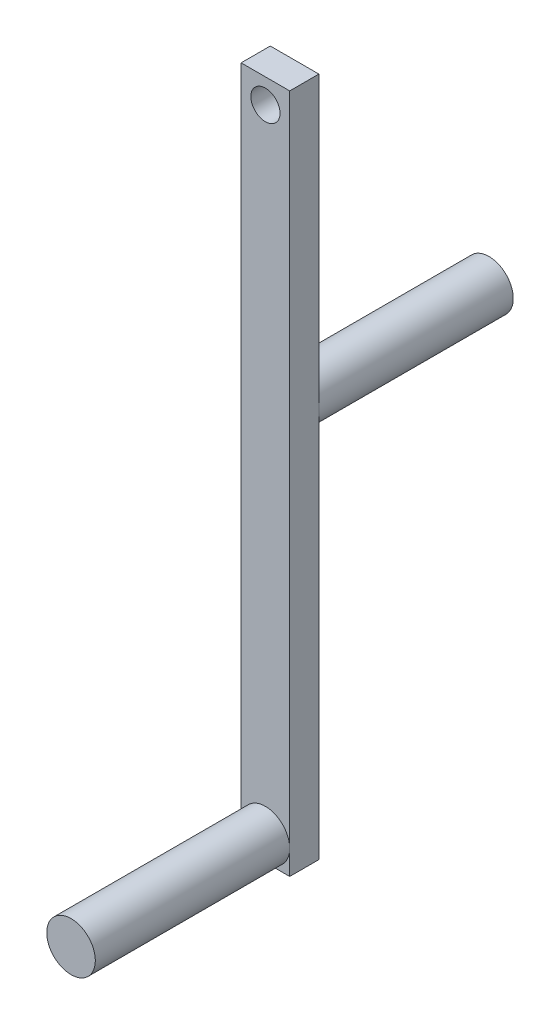
ISO-10303-21;
HEADER;
FILE_DESCRIPTION(('STEP AP214'),'2;1');
FILE_NAME('part.step','',(''),(''),'','','');
FILE_SCHEMA(('AUTOMOTIVE_DESIGN { 1 0 10303 214 1 1 1 1 }'));
ENDSEC;
DATA;
#1=APPLICATION_CONTEXT('core data for automotive mechanical design processes');
#2=APPLICATION_PROTOCOL_DEFINITION('international standard','automotive_design',2000,#1);
#3=PRODUCT_CONTEXT('',#1,'mechanical');
#4=PRODUCT('Part','Part','',(#3));
#5=PRODUCT_RELATED_PRODUCT_CATEGORY('part','',(#4));
#6=PRODUCT_DEFINITION_FORMATION('','',#4);
#7=PRODUCT_DEFINITION_CONTEXT('part definition',#1,'design');
#8=PRODUCT_DEFINITION('design','',#6,#7);
#9=PRODUCT_DEFINITION_SHAPE('','',#8);
#10=(LENGTH_UNIT() NAMED_UNIT(*) SI_UNIT(.MILLI.,.METRE.));
#11=(NAMED_UNIT(*) PLANE_ANGLE_UNIT() SI_UNIT($,.RADIAN.));
#12=(NAMED_UNIT(*) SI_UNIT($,.STERADIAN.) SOLID_ANGLE_UNIT());
#13=UNCERTAINTY_MEASURE_WITH_UNIT(LENGTH_MEASURE(1.E-05),#10,'distance_accuracy_value','');
#14=(GEOMETRIC_REPRESENTATION_CONTEXT(3) GLOBAL_UNCERTAINTY_ASSIGNED_CONTEXT((#13)) GLOBAL_UNIT_ASSIGNED_CONTEXT((#10,
#11,#12)) REPRESENTATION_CONTEXT('',''));
#15=CARTESIAN_POINT('',(0.,0.,0.));
#16=DIRECTION('',(0.,0.,1.));
#17=DIRECTION('',(1.,0.,0.));
#18=AXIS2_PLACEMENT_3D('',#15,#16,#17);
#19=CARTESIAN_POINT('',(0.,0.,0.));
#20=DIRECTION('',(0.,0.,-1.));
#21=DIRECTION('',(-1.,0.,0.));
#22=AXIS2_PLACEMENT_3D('',#19,#20,#21);
#23=PLANE('',#22);
#24=CARTESIAN_POINT('',(2.5,67.5,0.));
#25=DIRECTION('',(0.,0.,-1.));
#26=DIRECTION('',(-1.,0.,0.));
#27=AXIS2_PLACEMENT_3D('',#24,#25,#26);
#28=CIRCLE('',#27,1.5);
#29=CARTESIAN_POINT('',(0.999999999999999,67.5,0.));
#30=VERTEX_POINT('',#29);
#31=EDGE_CURVE('E269',#30,#30,#28,.T.);
#32=ORIENTED_EDGE('',*,*,#31,.F.);
#33=EDGE_LOOP('',(#32));
#34=FACE_BOUND('',#33,.T.);
#35=CARTESIAN_POINT('',(2.50000000000002,40.,0.));
#36=DIRECTION('',(0.,0.,-1.));
#37=DIRECTION('',(-1.,0.,0.));
#38=AXIS2_PLACEMENT_3D('',#35,#36,#37);
#39=CIRCLE('',#38,2.49999999999998);
#40=CARTESIAN_POINT('',(0.,40.,0.));
#41=VERTEX_POINT('',#40);
#42=CARTESIAN_POINT('',(5.,40.,0.));
#43=VERTEX_POINT('',#42);
#44=EDGE_CURVE('E44',#41,#43,#39,.T.);
#45=ORIENTED_EDGE('',*,*,#44,.F.);
#46=DIRECTION('',(0.,-1.,0.));
#47=VECTOR('',#46,1.);
#48=CARTESIAN_POINT('',(0.,0.,0.));
#49=LINE('',#48,#47);
#50=CARTESIAN_POINT('',(0.,70.,0.));
#51=VERTEX_POINT('',#50);
#52=EDGE_CURVE('E92',#51,#41,#49,.T.);
#53=ORIENTED_EDGE('',*,*,#52,.F.);
#54=DIRECTION('',(-1.,0.,0.));
#55=VECTOR('',#54,1.);
#56=CARTESIAN_POINT('',(0.,70.,0.));
#57=LINE('',#56,#55);
#58=CARTESIAN_POINT('',(5.,70.,0.));
#59=VERTEX_POINT('',#58);
#60=EDGE_CURVE('E174',#59,#51,#57,.T.);
#61=ORIENTED_EDGE('',*,*,#60,.F.);
#62=DIRECTION('',(0.,1.,0.));
#63=VECTOR('',#62,1.);
#64=CARTESIAN_POINT('',(5.,0.,0.));
#65=LINE('',#64,#63);
#66=EDGE_CURVE('E108',#43,#59,#65,.T.);
#67=ORIENTED_EDGE('',*,*,#66,.F.);
#68=EDGE_LOOP('',(#45,#53,#61,#67));
#69=FACE_BOUND('',#68,.T.);
#70=ADVANCED_FACE('F33',(#34,#69),#23,.T.);
#71=CARTESIAN_POINT('',(0.,0.,3.));
#72=DIRECTION('',(0.,0.,-1.));
#73=DIRECTION('',(-1.,0.,0.));
#74=AXIS2_PLACEMENT_3D('',#71,#72,#73);
#75=PLANE('',#74);
#76=CARTESIAN_POINT('',(2.5,67.5,3.));
#77=DIRECTION('',(0.,0.,-1.));
#78=DIRECTION('',(-1.,0.,0.));
#79=AXIS2_PLACEMENT_3D('',#76,#77,#78);
#80=CIRCLE('',#79,1.5);
#81=CARTESIAN_POINT('',(0.999999999999999,67.5,3.));
#82=VERTEX_POINT('',#81);
#83=EDGE_CURVE('E37',#82,#82,#80,.T.);
#84=ORIENTED_EDGE('',*,*,#83,.T.);
#85=EDGE_LOOP('',(#84));
#86=FACE_BOUND('',#85,.T.);
#87=CARTESIAN_POINT('',(2.5,2.5,3.));
#88=DIRECTION('',(0.,0.,1.));
#89=DIRECTION('',(1.,0.,0.));
#90=AXIS2_PLACEMENT_3D('',#87,#88,#89);
#91=CIRCLE('',#90,2.5);
#92=CARTESIAN_POINT('',(5.,2.5,3.));
#93=VERTEX_POINT('',#92);
#94=CARTESIAN_POINT('',(0.,2.5,3.));
#95=VERTEX_POINT('',#94);
#96=EDGE_CURVE('E170',#93,#95,#91,.T.);
#97=ORIENTED_EDGE('',*,*,#96,.F.);
#98=DIRECTION('',(0.,1.,0.));
#99=VECTOR('',#98,1.);
#100=CARTESIAN_POINT('',(5.,0.,3.));
#101=LINE('',#100,#99);
#102=CARTESIAN_POINT('',(5.,70.,3.));
#103=VERTEX_POINT('',#102);
#104=EDGE_CURVE('E201',#93,#103,#101,.T.);
#105=ORIENTED_EDGE('',*,*,#104,.T.);
#106=DIRECTION('',(-1.,0.,0.));
#107=VECTOR('',#106,1.);
#108=CARTESIAN_POINT('',(0.,70.,3.));
#109=LINE('',#108,#107);
#110=CARTESIAN_POINT('',(0.,70.,3.));
#111=VERTEX_POINT('',#110);
#112=EDGE_CURVE('E179',#103,#111,#109,.T.);
#113=ORIENTED_EDGE('',*,*,#112,.T.);
#114=DIRECTION('',(0.,-1.,0.));
#115=VECTOR('',#114,1.);
#116=CARTESIAN_POINT('',(0.,0.,3.));
#117=LINE('',#116,#115);
#118=EDGE_CURVE('E172',#111,#95,#117,.T.);
#119=ORIENTED_EDGE('',*,*,#118,.T.);
#120=EDGE_LOOP('',(#97,#105,#113,#119));
#121=FACE_BOUND('',#120,.T.);
#122=ADVANCED_FACE('F130',(#86,#121),#75,.F.);
#123=CARTESIAN_POINT('',(2.5,0.,3.));
#124=VERTEX_POINT('',#123);
#125=EDGE_CURVE('E42',#95,#124,#91,.T.);
#126=ORIENTED_EDGE('',*,*,#125,.F.);
#127=CARTESIAN_POINT('',(0.,0.,3.));
#128=VERTEX_POINT('',#127);
#129=EDGE_CURVE('E164',#95,#128,#117,.T.);
#130=ORIENTED_EDGE('',*,*,#129,.T.);
#131=DIRECTION('',(1.,0.,0.));
#132=VECTOR('',#131,1.);
#133=CARTESIAN_POINT('',(0.,0.,3.));
#134=LINE('',#133,#132);
#135=EDGE_CURVE('E166',#128,#124,#134,.T.);
#136=ORIENTED_EDGE('',*,*,#135,.T.);
#137=EDGE_LOOP('',(#126,#130,#136));
#138=FACE_BOUND('',#137,.T.);
#139=ADVANCED_FACE('F136',(#138),#75,.F.);
#140=CARTESIAN_POINT('',(0.,0.,3.));
#141=DIRECTION('',(1.,0.,0.));
#142=DIRECTION('',(0.,0.,-1.));
#143=AXIS2_PLACEMENT_3D('',#140,#141,#142);
#144=PLANE('',#143);
#145=ORIENTED_EDGE('',*,*,#52,.T.);
#146=CARTESIAN_POINT('',(0.,0.,0.));
#147=VERTEX_POINT('',#146);
#148=EDGE_CURVE('E94',#41,#147,#49,.T.);
#149=ORIENTED_EDGE('',*,*,#148,.T.);
#150=DIRECTION('',(0.,0.,-1.));
#151=VECTOR('',#150,1.);
#152=CARTESIAN_POINT('',(0.,0.,3.));
#153=LINE('',#152,#151);
#154=EDGE_CURVE('E173',#128,#147,#153,.T.);
#155=ORIENTED_EDGE('',*,*,#154,.F.);
#156=ORIENTED_EDGE('',*,*,#129,.F.);
#157=ORIENTED_EDGE('',*,*,#118,.F.);
#158=DIRECTION('',(0.,0.,-1.));
#159=VECTOR('',#158,1.);
#160=CARTESIAN_POINT('',(0.,70.,3.));
#161=LINE('',#160,#159);
#162=EDGE_CURVE('E98',#111,#51,#161,.T.);
#163=ORIENTED_EDGE('',*,*,#162,.T.);
#164=EDGE_LOOP('',(#145,#149,#155,#156,#157,#163));
#165=FACE_BOUND('',#164,.T.);
#166=ADVANCED_FACE('F35',(#165),#144,.F.);
#167=CARTESIAN_POINT('',(0.,0.,3.));
#168=DIRECTION('',(0.,1.,0.));
#169=DIRECTION('',(0.,0.,1.));
#170=AXIS2_PLACEMENT_3D('',#167,#168,#169);
#171=PLANE('',#170);
#172=DIRECTION('',(1.,0.,0.));
#173=VECTOR('',#172,1.);
#174=CARTESIAN_POINT('',(0.,0.,0.));
#175=LINE('',#174,#173);
#176=CARTESIAN_POINT('',(5.,0.,0.));
#177=VERTEX_POINT('',#176);
#178=EDGE_CURVE('E102',#147,#177,#175,.T.);
#179=ORIENTED_EDGE('',*,*,#178,.T.);
#180=DIRECTION('',(0.,0.,-1.));
#181=VECTOR('',#180,1.);
#182=CARTESIAN_POINT('',(5.,0.,3.));
#183=LINE('',#182,#181);
#184=CARTESIAN_POINT('',(5.,0.,3.));
#185=VERTEX_POINT('',#184);
#186=EDGE_CURVE('E185',#185,#177,#183,.T.);
#187=ORIENTED_EDGE('',*,*,#186,.F.);
#188=EDGE_CURVE('E180',#124,#185,#134,.T.);
#189=ORIENTED_EDGE('',*,*,#188,.F.);
#190=ORIENTED_EDGE('',*,*,#135,.F.);
#191=ORIENTED_EDGE('',*,*,#154,.T.);
#192=EDGE_LOOP('',(#179,#187,#189,#190,#191));
#193=FACE_BOUND('',#192,.T.);
#194=ADVANCED_FACE('F160',(#193),#171,.F.);
#195=CARTESIAN_POINT('',(5.,0.,3.));
#196=DIRECTION('',(-1.,0.,0.));
#197=DIRECTION('',(0.,0.,1.));
#198=AXIS2_PLACEMENT_3D('',#195,#196,#197);
#199=PLANE('',#198);
#200=EDGE_CURVE('E195',#177,#43,#65,.T.);
#201=ORIENTED_EDGE('',*,*,#200,.T.);
#202=ORIENTED_EDGE('',*,*,#66,.T.);
#203=DIRECTION('',(0.,0.,-1.));
#204=VECTOR('',#203,1.);
#205=CARTESIAN_POINT('',(5.,70.,3.));
#206=LINE('',#205,#204);
#207=EDGE_CURVE('E188',#103,#59,#206,.T.);
#208=ORIENTED_EDGE('',*,*,#207,.F.);
#209=ORIENTED_EDGE('',*,*,#104,.F.);
#210=EDGE_CURVE('E199',#185,#93,#101,.T.);
#211=ORIENTED_EDGE('',*,*,#210,.F.);
#212=ORIENTED_EDGE('',*,*,#186,.T.);
#213=EDGE_LOOP('',(#201,#202,#208,#209,#211,#212));
#214=FACE_BOUND('',#213,.T.);
#215=ADVANCED_FACE('F153',(#214),#199,.F.);
#216=CARTESIAN_POINT('',(0.,70.,3.));
#217=DIRECTION('',(0.,-1.,0.));
#218=DIRECTION('',(0.,0.,-1.));
#219=AXIS2_PLACEMENT_3D('',#216,#217,#218);
#220=PLANE('',#219);
#221=ORIENTED_EDGE('',*,*,#60,.T.);
#222=ORIENTED_EDGE('',*,*,#162,.F.);
#223=ORIENTED_EDGE('',*,*,#112,.F.);
#224=ORIENTED_EDGE('',*,*,#207,.T.);
#225=EDGE_LOOP('',(#221,#222,#223,#224));
#226=FACE_BOUND('',#225,.T.);
#227=ADVANCED_FACE('F149',(#226),#220,.F.);
#228=EDGE_CURVE('E57',#124,#93,#91,.T.);
#229=ORIENTED_EDGE('',*,*,#228,.F.);
#230=ORIENTED_EDGE('',*,*,#188,.T.);
#231=ORIENTED_EDGE('',*,*,#210,.T.);
#232=EDGE_LOOP('',(#229,#230,#231));
#233=FACE_BOUND('',#232,.T.);
#234=ADVANCED_FACE('F139',(#233),#75,.F.);
#235=EDGE_CURVE('E11',#43,#41,#39,.T.);
#236=ORIENTED_EDGE('',*,*,#235,.F.);
#237=ORIENTED_EDGE('',*,*,#200,.F.);
#238=ORIENTED_EDGE('',*,*,#178,.F.);
#239=ORIENTED_EDGE('',*,*,#148,.F.);
#240=EDGE_LOOP('',(#236,#237,#238,#239));
#241=FACE_BOUND('',#240,.T.);
#242=ADVANCED_FACE('F104',(#241),#23,.T.);
#243=CARTESIAN_POINT('',(2.5,2.5,23.));
#244=DIRECTION('',(0.,0.,-1.));
#245=DIRECTION('',(-1.,0.,0.));
#246=AXIS2_PLACEMENT_3D('',#243,#244,#245);
#247=CYLINDRICAL_SURFACE('',#246,2.5);
#248=CARTESIAN_POINT('',(2.5,2.5,23.));
#249=DIRECTION('',(0.,0.,1.));
#250=DIRECTION('',(1.,0.,0.));
#251=AXIS2_PLACEMENT_3D('',#248,#249,#250);
#252=CIRCLE('',#251,2.5);
#253=CARTESIAN_POINT('',(5.,2.5,23.));
#254=VERTEX_POINT('',#253);
#255=EDGE_CURVE('E106',#254,#254,#252,.T.);
#256=ORIENTED_EDGE('',*,*,#255,.F.);
#257=EDGE_LOOP('',(#256));
#258=FACE_BOUND('',#257,.T.);
#259=ORIENTED_EDGE('',*,*,#96,.T.);
#260=ORIENTED_EDGE('',*,*,#125,.T.);
#261=ORIENTED_EDGE('',*,*,#228,.T.);
#262=EDGE_LOOP('',(#259,#260,#261));
#263=FACE_BOUND('',#262,.T.);
#264=ADVANCED_FACE('F125',(#258,#263),#247,.T.);
#265=CARTESIAN_POINT('',(2.5,2.5,23.));
#266=DIRECTION('',(0.,0.,1.));
#267=DIRECTION('',(1.,0.,0.));
#268=AXIS2_PLACEMENT_3D('',#265,#266,#267);
#269=PLANE('',#268);
#270=ORIENTED_EDGE('',*,*,#255,.T.);
#271=EDGE_LOOP('',(#270));
#272=FACE_BOUND('',#271,.T.);
#273=ADVANCED_FACE('F115',(#272),#269,.T.);
#274=CARTESIAN_POINT('',(2.50000000000002,40.,-20.));
#275=DIRECTION('',(0.,0.,1.));
#276=DIRECTION('',(1.,0.,0.));
#277=AXIS2_PLACEMENT_3D('',#274,#275,#276);
#278=CYLINDRICAL_SURFACE('',#277,2.49999999999998);
#279=CARTESIAN_POINT('',(2.50000000000002,40.,-20.));
#280=DIRECTION('',(0.,0.,-1.));
#281=DIRECTION('',(-1.,0.,0.));
#282=AXIS2_PLACEMENT_3D('',#279,#280,#281);
#283=CIRCLE('',#282,2.49999999999998);
#284=CARTESIAN_POINT('',(0.,40.,-20.));
#285=VERTEX_POINT('',#284);
#286=EDGE_CURVE('E111',#285,#285,#283,.T.);
#287=ORIENTED_EDGE('',*,*,#286,.F.);
#288=EDGE_LOOP('',(#287));
#289=FACE_BOUND('',#288,.T.);
#290=ORIENTED_EDGE('',*,*,#44,.T.);
#291=ORIENTED_EDGE('',*,*,#235,.T.);
#292=EDGE_LOOP('',(#290,#291));
#293=FACE_BOUND('',#292,.T.);
#294=ADVANCED_FACE('F112',(#289,#293),#278,.T.);
#295=CARTESIAN_POINT('',(2.50000000000002,40.,-20.));
#296=DIRECTION('',(0.,0.,-1.));
#297=DIRECTION('',(-1.,0.,0.));
#298=AXIS2_PLACEMENT_3D('',#295,#296,#297);
#299=PLANE('',#298);
#300=ORIENTED_EDGE('',*,*,#286,.T.);
#301=EDGE_LOOP('',(#300));
#302=FACE_BOUND('',#301,.T.);
#303=ADVANCED_FACE('F114',(#302),#299,.T.);
#304=CARTESIAN_POINT('',(2.5,67.5,20.));
#305=DIRECTION('',(0.,0.,-1.));
#306=DIRECTION('',(-1.,0.,0.));
#307=AXIS2_PLACEMENT_3D('',#304,#305,#306);
#308=CYLINDRICAL_SURFACE('',#307,1.5);
#309=ORIENTED_EDGE('',*,*,#31,.T.);
#310=EDGE_LOOP('',(#309));
#311=FACE_BOUND('',#310,.T.);
#312=ORIENTED_EDGE('',*,*,#83,.F.);
#313=EDGE_LOOP('',(#312));
#314=FACE_BOUND('',#313,.T.);
#315=ADVANCED_FACE('F122',(#311,#314),#308,.F.);
#316=CLOSED_SHELL('',(#70,#122,#139,#166,#194,#215,#227,#234,#242,#264,#273,#294,#303,#315));
#317=MANIFOLD_SOLID_BREP('B2',#316);
#318=ADVANCED_BREP_SHAPE_REPRESENTATION('',(#18,#317),#14);
#319=SHAPE_DEFINITION_REPRESENTATION(#9,#318);
ENDSEC;
END-ISO-10303-21;
